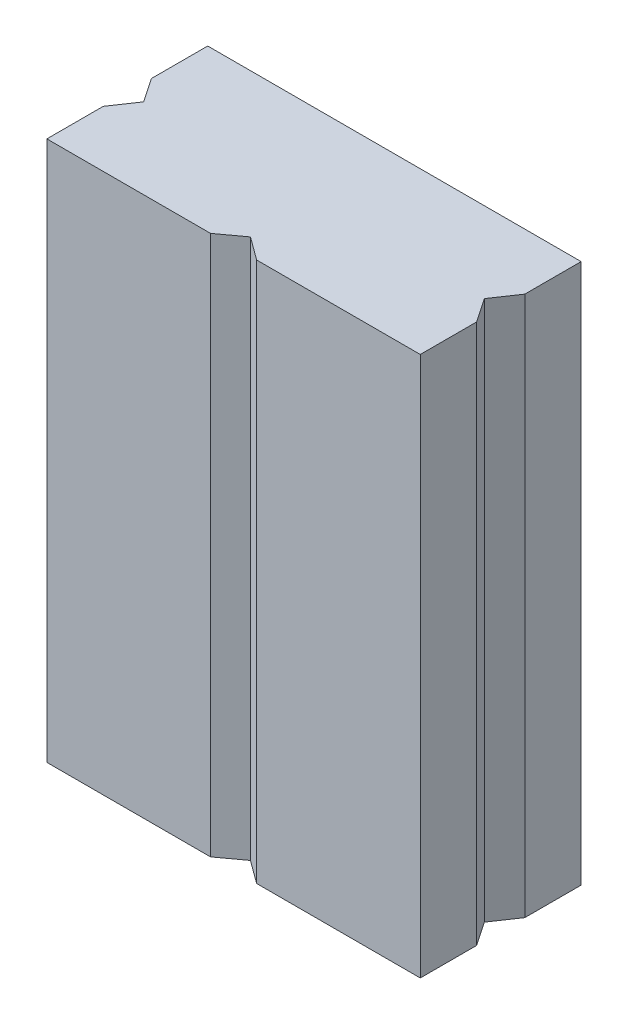
ISO-10303-21;
HEADER;
FILE_DESCRIPTION(('STEP AP214'),'2;1');
FILE_NAME('part.step','',(''),(''),'','','');
FILE_SCHEMA(('AUTOMOTIVE_DESIGN { 1 0 10303 214 1 1 1 1 }'));
ENDSEC;
DATA;
#1=APPLICATION_CONTEXT('core data for automotive mechanical design processes');
#2=APPLICATION_PROTOCOL_DEFINITION('international standard','automotive_design',2000,#1);
#3=PRODUCT_CONTEXT('',#1,'mechanical');
#4=PRODUCT('Part','Part','',(#3));
#5=PRODUCT_RELATED_PRODUCT_CATEGORY('part','',(#4));
#6=PRODUCT_DEFINITION_FORMATION('','',#4);
#7=PRODUCT_DEFINITION_CONTEXT('part definition',#1,'design');
#8=PRODUCT_DEFINITION('design','',#6,#7);
#9=PRODUCT_DEFINITION_SHAPE('','',#8);
#10=(LENGTH_UNIT() NAMED_UNIT(*) SI_UNIT(.MILLI.,.METRE.));
#11=(NAMED_UNIT(*) PLANE_ANGLE_UNIT() SI_UNIT($,.RADIAN.));
#12=(NAMED_UNIT(*) SI_UNIT($,.STERADIAN.) SOLID_ANGLE_UNIT());
#13=UNCERTAINTY_MEASURE_WITH_UNIT(LENGTH_MEASURE(1.E-05),#10,'distance_accuracy_value','');
#14=(GEOMETRIC_REPRESENTATION_CONTEXT(3) GLOBAL_UNCERTAINTY_ASSIGNED_CONTEXT((#13)) GLOBAL_UNIT_ASSIGNED_CONTEXT((#10,
#11,#12)) REPRESENTATION_CONTEXT('',''));
#15=CARTESIAN_POINT('',(0.,0.,0.));
#16=DIRECTION('',(0.,0.,1.));
#17=DIRECTION('',(1.,0.,0.));
#18=AXIS2_PLACEMENT_3D('',#15,#16,#17);
#19=CARTESIAN_POINT('',(9.9432888395153,94.,13.5786649910923));
#20=DIRECTION('',(0.590807171669104,0.,0.806812794831834));
#21=DIRECTION('',(0.806812794831834,0.,-0.590807171669104));
#22=AXIS2_PLACEMENT_3D('',#19,#20,#21);
#23=PLANE('',#22);
#24=DIRECTION('',(-0.806812794831834,0.,0.590807171669104));
#25=VECTOR('',#24,1.);
#26=CARTESIAN_POINT('',(9.9432888395153,0.,13.5786649910923));
#27=LINE('',#26,#25);
#28=CARTESIAN_POINT('',(32.5,0.,-2.93900404966774));
#29=VERTEX_POINT('',#28);
#30=CARTESIAN_POINT('',(28.486463629689,0.,0.));
#31=VERTEX_POINT('',#30);
#32=EDGE_CURVE('E184',#29,#31,#27,.T.);
#33=ORIENTED_EDGE('',*,*,#32,.F.);
#34=DIRECTION('',(0.,-1.,0.));
#35=VECTOR('',#34,1.);
#36=CARTESIAN_POINT('',(32.5,94.,-2.93900404966774));
#37=LINE('',#36,#35);
#38=CARTESIAN_POINT('',(32.5,94.,-2.93900404966774));
#39=VERTEX_POINT('',#38);
#40=EDGE_CURVE('E11',#39,#29,#37,.T.);
#41=ORIENTED_EDGE('',*,*,#40,.F.);
#42=DIRECTION('',(-0.806812794831834,0.,0.590807171669104));
#43=VECTOR('',#42,1.);
#44=CARTESIAN_POINT('',(9.9432888395153,94.,13.5786649910923));
#45=LINE('',#44,#43);
#46=CARTESIAN_POINT('',(28.486463629689,94.,0.));
#47=VERTEX_POINT('',#46);
#48=EDGE_CURVE('E176',#39,#47,#45,.T.);
#49=ORIENTED_EDGE('',*,*,#48,.T.);
#50=DIRECTION('',(0.,-1.,0.));
#51=VECTOR('',#50,1.);
#52=CARTESIAN_POINT('',(28.486463629689,94.,0.));
#53=LINE('',#52,#51);
#54=EDGE_CURVE('E102',#47,#31,#53,.T.);
#55=ORIENTED_EDGE('',*,*,#54,.T.);
#56=EDGE_LOOP('',(#33,#41,#49,#55));
#57=FACE_BOUND('',#56,.T.);
#58=ADVANCED_FACE('F36',(#57),#23,.T.);
#59=CARTESIAN_POINT('',(12.7451635767017,94.,-17.4049360586753));
#60=DIRECTION('',(0.590807171669104,0.,-0.806812794831834));
#61=DIRECTION('',(-0.806812794831834,0.,-0.590807171669104));
#62=AXIS2_PLACEMENT_3D('',#59,#60,#61);
#63=PLANE('',#62);
#64=DIRECTION('',(0.806812794831834,0.,0.590807171669104));
#65=VECTOR('',#64,1.);
#66=CARTESIAN_POINT('',(12.7451635767017,0.,-17.4049360586753));
#67=LINE('',#66,#65);
#68=CARTESIAN_POINT('',(36.513536370311,0.,0.));
#69=VERTEX_POINT('',#68);
#70=EDGE_CURVE('E188',#29,#69,#67,.T.);
#71=ORIENTED_EDGE('',*,*,#70,.T.);
#72=DIRECTION('',(0.,-1.,0.));
#73=VECTOR('',#72,1.);
#74=CARTESIAN_POINT('',(36.513536370311,94.,0.));
#75=LINE('',#74,#73);
#76=CARTESIAN_POINT('',(36.513536370311,94.,0.));
#77=VERTEX_POINT('',#76);
#78=EDGE_CURVE('E44',#77,#69,#75,.T.);
#79=ORIENTED_EDGE('',*,*,#78,.F.);
#80=DIRECTION('',(0.806812794831834,0.,0.590807171669104));
#81=VECTOR('',#80,1.);
#82=CARTESIAN_POINT('',(12.7451635767017,94.,-17.4049360586753));
#83=LINE('',#82,#81);
#84=EDGE_CURVE('E174',#39,#77,#83,.T.);
#85=ORIENTED_EDGE('',*,*,#84,.F.);
#86=ORIENTED_EDGE('',*,*,#40,.T.);
#87=EDGE_LOOP('',(#71,#79,#85,#86));
#88=FACE_BOUND('',#87,.T.);
#89=ADVANCED_FACE('F252',(#88),#63,.F.);
#90=CARTESIAN_POINT('',(0.,94.,0.));
#91=DIRECTION('',(0.,0.,-1.));
#92=DIRECTION('',(-1.,0.,0.));
#93=AXIS2_PLACEMENT_3D('',#90,#91,#92);
#94=PLANE('',#93);
#95=DIRECTION('',(1.,0.,0.));
#96=VECTOR('',#95,1.);
#97=CARTESIAN_POINT('',(0.,0.,0.));
#98=LINE('',#97,#96);
#99=CARTESIAN_POINT('',(65.,0.,0.));
#100=VERTEX_POINT('',#99);
#101=EDGE_CURVE('E193',#69,#100,#98,.T.);
#102=ORIENTED_EDGE('',*,*,#101,.T.);
#103=DIRECTION('',(0.,-1.,0.));
#104=VECTOR('',#103,1.);
#105=CARTESIAN_POINT('',(65.,94.,0.));
#106=LINE('',#105,#104);
#107=CARTESIAN_POINT('',(65.,94.,0.));
#108=VERTEX_POINT('',#107);
#109=EDGE_CURVE('E233',#108,#100,#106,.T.);
#110=ORIENTED_EDGE('',*,*,#109,.F.);
#111=DIRECTION('',(1.,0.,0.));
#112=VECTOR('',#111,1.);
#113=CARTESIAN_POINT('',(0.,94.,0.));
#114=LINE('',#113,#112);
#115=EDGE_CURVE('E157',#77,#108,#114,.T.);
#116=ORIENTED_EDGE('',*,*,#115,.F.);
#117=ORIENTED_EDGE('',*,*,#78,.T.);
#118=EDGE_LOOP('',(#102,#110,#116,#117));
#119=FACE_BOUND('',#118,.T.);
#120=ADVANCED_FACE('F240',(#119),#94,.F.);
#121=CARTESIAN_POINT('',(65.,94.,0.));
#122=DIRECTION('',(-1.,0.,0.));
#123=DIRECTION('',(0.,0.,1.));
#124=AXIS2_PLACEMENT_3D('',#121,#122,#123);
#125=PLANE('',#124);
#126=DIRECTION('',(0.,0.,-1.));
#127=VECTOR('',#126,1.);
#128=CARTESIAN_POINT('',(65.,0.,0.));
#129=LINE('',#128,#127);
#130=CARTESIAN_POINT('',(65.,0.,-9.80576368607577));
#131=VERTEX_POINT('',#130);
#132=EDGE_CURVE('E197',#100,#131,#129,.T.);
#133=ORIENTED_EDGE('',*,*,#132,.T.);
#134=DIRECTION('',(0.,-1.,0.));
#135=VECTOR('',#134,1.);
#136=CARTESIAN_POINT('',(65.,94.,-9.80576368607577));
#137=LINE('',#136,#135);
#138=CARTESIAN_POINT('',(65.,94.,-9.80576368607577));
#139=VERTEX_POINT('',#138);
#140=EDGE_CURVE('E231',#139,#131,#137,.T.);
#141=ORIENTED_EDGE('',*,*,#140,.F.);
#142=DIRECTION('',(0.,0.,-1.));
#143=VECTOR('',#142,1.);
#144=CARTESIAN_POINT('',(65.,94.,0.));
#145=LINE('',#144,#143);
#146=EDGE_CURVE('E168',#108,#139,#145,.T.);
#147=ORIENTED_EDGE('',*,*,#146,.F.);
#148=ORIENTED_EDGE('',*,*,#109,.T.);
#149=EDGE_LOOP('',(#133,#141,#147,#148));
#150=FACE_BOUND('',#149,.T.);
#151=ADVANCED_FACE('F249',(#150),#125,.F.);
#152=CARTESIAN_POINT('',(49.1503968274011,94.,-33.2410634335504));
#153=DIRECTION('',(0.828343903131239,0.,-0.560219937297223));
#154=DIRECTION('',(-0.560219937297223,0.,-0.828343903131239));
#155=AXIS2_PLACEMENT_3D('',#152,#153,#154);
#156=PLANE('',#155);
#157=DIRECTION('',(0.560219937297223,0.,0.828343903131239));
#158=VECTOR('',#157,1.);
#159=CARTESIAN_POINT('',(49.1503968274011,0.,-33.2410634335504));
#160=LINE('',#159,#158);
#161=CARTESIAN_POINT('',(62.1633825082623,0.,-14.));
#162=VERTEX_POINT('',#161);
#163=EDGE_CURVE('E200',#162,#131,#160,.T.);
#164=ORIENTED_EDGE('',*,*,#163,.F.);
#165=DIRECTION('',(0.,-1.,0.));
#166=VECTOR('',#165,1.);
#167=CARTESIAN_POINT('',(62.1633825082623,94.,-14.));
#168=LINE('',#167,#166);
#169=CARTESIAN_POINT('',(62.1633825082623,94.,-14.));
#170=VERTEX_POINT('',#169);
#171=EDGE_CURVE('E229',#170,#162,#168,.T.);
#172=ORIENTED_EDGE('',*,*,#171,.F.);
#173=DIRECTION('',(0.560219937297223,0.,0.828343903131239));
#174=VECTOR('',#173,1.);
#175=CARTESIAN_POINT('',(49.1503968274011,94.,-33.2410634335504));
#176=LINE('',#175,#174);
#177=EDGE_CURVE('E171',#170,#139,#176,.T.);
#178=ORIENTED_EDGE('',*,*,#177,.T.);
#179=ORIENTED_EDGE('',*,*,#140,.T.);
#180=EDGE_LOOP('',(#164,#172,#178,#179));
#181=FACE_BOUND('',#180,.T.);
#182=ADVANCED_FACE('F261',(#181),#156,.T.);
#183=CARTESIAN_POINT('',(36.156863282165,94.,24.4533648454819));
#184=DIRECTION('',(-0.828343903131239,0.,-0.560219937297223));
#185=DIRECTION('',(-0.560219937297223,0.,0.828343903131239));
#186=AXIS2_PLACEMENT_3D('',#183,#184,#185);
#187=PLANE('',#186);
#188=DIRECTION('',(0.560219937297223,0.,-0.828343903131239));
#189=VECTOR('',#188,1.);
#190=CARTESIAN_POINT('',(36.156863282165,0.,24.4533648454819));
#191=LINE('',#190,#189);
#192=CARTESIAN_POINT('',(65.,0.,-18.1942363139242));
#193=VERTEX_POINT('',#192);
#194=EDGE_CURVE('E204',#162,#193,#191,.T.);
#195=ORIENTED_EDGE('',*,*,#194,.T.);
#196=DIRECTION('',(0.,-1.,0.));
#197=VECTOR('',#196,1.);
#198=CARTESIAN_POINT('',(65.,94.,-18.1942363139242));
#199=LINE('',#198,#197);
#200=CARTESIAN_POINT('',(65.,94.,-18.1942363139242));
#201=VERTEX_POINT('',#200);
#202=EDGE_CURVE('E226',#201,#193,#199,.T.);
#203=ORIENTED_EDGE('',*,*,#202,.F.);
#204=DIRECTION('',(0.560219937297223,0.,-0.828343903131239));
#205=VECTOR('',#204,1.);
#206=CARTESIAN_POINT('',(36.156863282165,94.,24.4533648454819));
#207=LINE('',#206,#205);
#208=EDGE_CURVE('E166',#170,#201,#207,.T.);
#209=ORIENTED_EDGE('',*,*,#208,.F.);
#210=ORIENTED_EDGE('',*,*,#171,.T.);
#211=EDGE_LOOP('',(#195,#203,#209,#210));
#212=FACE_BOUND('',#211,.T.);
#213=ADVANCED_FACE('F264',(#212),#187,.F.);
#214=CARTESIAN_POINT('',(65.,0.,-28.));
#215=VERTEX_POINT('',#214);
#216=EDGE_CURVE('E201',#193,#215,#129,.T.);
#217=ORIENTED_EDGE('',*,*,#216,.T.);
#218=DIRECTION('',(0.,-1.,0.));
#219=VECTOR('',#218,1.);
#220=CARTESIAN_POINT('',(65.,94.,-28.));
#221=LINE('',#220,#219);
#222=CARTESIAN_POINT('',(65.,94.,-28.));
#223=VERTEX_POINT('',#222);
#224=EDGE_CURVE('E223',#223,#215,#221,.T.);
#225=ORIENTED_EDGE('',*,*,#224,.F.);
#226=EDGE_CURVE('E163',#201,#223,#145,.T.);
#227=ORIENTED_EDGE('',*,*,#226,.F.);
#228=ORIENTED_EDGE('',*,*,#202,.T.);
#229=EDGE_LOOP('',(#217,#225,#227,#228));
#230=FACE_BOUND('',#229,.T.);
#231=ADVANCED_FACE('F268',(#230),#125,.F.);
#232=CARTESIAN_POINT('',(0.,94.,-28.));
#233=DIRECTION('',(0.,0.,1.));
#234=DIRECTION('',(1.,0.,0.));
#235=AXIS2_PLACEMENT_3D('',#232,#233,#234);
#236=PLANE('',#235);
#237=DIRECTION('',(-1.,0.,0.));
#238=VECTOR('',#237,1.);
#239=CARTESIAN_POINT('',(0.,0.,-28.));
#240=LINE('',#239,#238);
#241=CARTESIAN_POINT('',(0.,0.,-28.));
#242=VERTEX_POINT('',#241);
#243=EDGE_CURVE('E206',#215,#242,#240,.T.);
#244=ORIENTED_EDGE('',*,*,#243,.T.);
#245=DIRECTION('',(0.,-1.,0.));
#246=VECTOR('',#245,1.);
#247=CARTESIAN_POINT('',(0.,94.,-28.));
#248=LINE('',#247,#246);
#249=CARTESIAN_POINT('',(0.,94.,-28.));
#250=VERTEX_POINT('',#249);
#251=EDGE_CURVE('E220',#250,#242,#248,.T.);
#252=ORIENTED_EDGE('',*,*,#251,.F.);
#253=DIRECTION('',(-1.,0.,0.));
#254=VECTOR('',#253,1.);
#255=CARTESIAN_POINT('',(0.,94.,-28.));
#256=LINE('',#255,#254);
#257=EDGE_CURVE('E160',#223,#250,#256,.T.);
#258=ORIENTED_EDGE('',*,*,#257,.F.);
#259=ORIENTED_EDGE('',*,*,#224,.T.);
#260=EDGE_LOOP('',(#244,#252,#258,#259));
#261=FACE_BOUND('',#260,.T.);
#262=ADVANCED_FACE('F272',(#261),#236,.F.);
#263=CARTESIAN_POINT('',(0.,94.,0.));
#264=DIRECTION('',(1.,0.,0.));
#265=DIRECTION('',(0.,0.,-1.));
#266=AXIS2_PLACEMENT_3D('',#263,#264,#265);
#267=PLANE('',#266);
#268=DIRECTION('',(0.,0.,1.));
#269=VECTOR('',#268,1.);
#270=CARTESIAN_POINT('',(0.,0.,0.));
#271=LINE('',#270,#269);
#272=CARTESIAN_POINT('',(0.,0.,-18.1942363139242));
#273=VERTEX_POINT('',#272);
#274=EDGE_CURVE('E208',#242,#273,#271,.T.);
#275=ORIENTED_EDGE('',*,*,#274,.T.);
#276=DIRECTION('',(0.,-1.,0.));
#277=VECTOR('',#276,1.);
#278=CARTESIAN_POINT('',(0.,94.,-18.1942363139242));
#279=LINE('',#278,#277);
#280=CARTESIAN_POINT('',(0.,94.,-18.1942363139242));
#281=VERTEX_POINT('',#280);
#282=EDGE_CURVE('E218',#281,#273,#279,.T.);
#283=ORIENTED_EDGE('',*,*,#282,.F.);
#284=DIRECTION('',(0.,0.,1.));
#285=VECTOR('',#284,1.);
#286=CARTESIAN_POINT('',(0.,94.,0.));
#287=LINE('',#286,#285);
#288=EDGE_CURVE('E155',#250,#281,#287,.T.);
#289=ORIENTED_EDGE('',*,*,#288,.F.);
#290=ORIENTED_EDGE('',*,*,#251,.T.);
#291=EDGE_LOOP('',(#275,#283,#289,#290));
#292=FACE_BOUND('',#291,.T.);
#293=ADVANCED_FACE('F276',(#292),#267,.F.);
#294=CARTESIAN_POINT('',(8.44312213839028,94.,-5.71019517024488));
#295=DIRECTION('',(-0.828343903131239,0.,0.560219937297223));
#296=DIRECTION('',(0.560219937297223,0.,0.828343903131239));
#297=AXIS2_PLACEMENT_3D('',#294,#295,#296);
#298=PLANE('',#297);
#299=DIRECTION('',(-0.560219937297223,0.,-0.828343903131239));
#300=VECTOR('',#299,1.);
#301=CARTESIAN_POINT('',(8.44312213839028,0.,-5.71019517024488));
#302=LINE('',#301,#300);
#303=CARTESIAN_POINT('',(2.83661749173769,0.,-14.));
#304=VERTEX_POINT('',#303);
#305=EDGE_CURVE('E211',#304,#273,#302,.T.);
#306=ORIENTED_EDGE('',*,*,#305,.F.);
#307=DIRECTION('',(0.,-1.,0.));
#308=VECTOR('',#307,1.);
#309=CARTESIAN_POINT('',(2.83661749173769,94.,-14.));
#310=LINE('',#309,#308);
#311=CARTESIAN_POINT('',(2.83661749173769,94.,-14.));
#312=VERTEX_POINT('',#311);
#313=EDGE_CURVE('E150',#312,#304,#310,.T.);
#314=ORIENTED_EDGE('',*,*,#313,.F.);
#315=DIRECTION('',(-0.560219937297223,0.,-0.828343903131239));
#316=VECTOR('',#315,1.);
#317=CARTESIAN_POINT('',(8.44312213839028,94.,-5.71019517024488));
#318=LINE('',#317,#316);
#319=EDGE_CURVE('E143',#312,#281,#318,.T.);
#320=ORIENTED_EDGE('',*,*,#319,.T.);
#321=ORIENTED_EDGE('',*,*,#282,.T.);
#322=EDGE_LOOP('',(#306,#314,#320,#321));
#323=FACE_BOUND('',#322,.T.);
#324=ADVANCED_FACE('F278',(#323),#298,.T.);
#325=CARTESIAN_POINT('',(-4.55041140684587,94.,-3.07750341782364));
#326=DIRECTION('',(0.828343903131239,0.,0.560219937297223));
#327=DIRECTION('',(0.560219937297223,0.,-0.828343903131239));
#328=AXIS2_PLACEMENT_3D('',#325,#326,#327);
#329=PLANE('',#328);
#330=DIRECTION('',(-0.560219937297223,0.,0.828343903131239));
#331=VECTOR('',#330,1.);
#332=CARTESIAN_POINT('',(-4.55041140684587,0.,-3.07750341782364));
#333=LINE('',#332,#331);
#334=CARTESIAN_POINT('',(0.,0.,-9.80576368607581));
#335=VERTEX_POINT('',#334);
#336=EDGE_CURVE('E149',#304,#335,#333,.T.);
#337=ORIENTED_EDGE('',*,*,#336,.T.);
#338=DIRECTION('',(0.,-1.,0.));
#339=VECTOR('',#338,1.);
#340=CARTESIAN_POINT('',(0.,94.,-9.80576368607581));
#341=LINE('',#340,#339);
#342=CARTESIAN_POINT('',(0.,94.,-9.80576368607581));
#343=VERTEX_POINT('',#342);
#344=EDGE_CURVE('E146',#343,#335,#341,.T.);
#345=ORIENTED_EDGE('',*,*,#344,.F.);
#346=DIRECTION('',(-0.560219937297223,0.,0.828343903131239));
#347=VECTOR('',#346,1.);
#348=CARTESIAN_POINT('',(-4.55041140684587,94.,-3.07750341782364));
#349=LINE('',#348,#347);
#350=EDGE_CURVE('E137',#312,#343,#349,.T.);
#351=ORIENTED_EDGE('',*,*,#350,.F.);
#352=ORIENTED_EDGE('',*,*,#313,.T.);
#353=EDGE_LOOP('',(#337,#345,#351,#352));
#354=FACE_BOUND('',#353,.T.);
#355=ADVANCED_FACE('F147',(#354),#329,.F.);
#356=CARTESIAN_POINT('',(0.,0.,0.));
#357=VERTEX_POINT('',#356);
#358=EDGE_CURVE('E95',#335,#357,#271,.T.);
#359=ORIENTED_EDGE('',*,*,#358,.T.);
#360=DIRECTION('',(0.,-1.,0.));
#361=VECTOR('',#360,1.);
#362=CARTESIAN_POINT('',(0.,94.,0.));
#363=LINE('',#362,#361);
#364=CARTESIAN_POINT('',(0.,94.,0.));
#365=VERTEX_POINT('',#364);
#366=EDGE_CURVE('E151',#365,#357,#363,.T.);
#367=ORIENTED_EDGE('',*,*,#366,.F.);
#368=EDGE_CURVE('E141',#343,#365,#287,.T.);
#369=ORIENTED_EDGE('',*,*,#368,.F.);
#370=ORIENTED_EDGE('',*,*,#344,.T.);
#371=EDGE_LOOP('',(#359,#367,#369,#370));
#372=FACE_BOUND('',#371,.T.);
#373=ADVANCED_FACE('F153',(#372),#267,.F.);
#374=EDGE_CURVE('E178',#357,#31,#98,.T.);
#375=ORIENTED_EDGE('',*,*,#374,.T.);
#376=ORIENTED_EDGE('',*,*,#54,.F.);
#377=EDGE_CURVE('E52',#365,#47,#114,.T.);
#378=ORIENTED_EDGE('',*,*,#377,.F.);
#379=ORIENTED_EDGE('',*,*,#366,.T.);
#380=EDGE_LOOP('',(#375,#376,#378,#379));
#381=FACE_BOUND('',#380,.T.);
#382=ADVANCED_FACE('F259',(#381),#94,.F.);
#383=CARTESIAN_POINT('',(0.,94.,0.));
#384=DIRECTION('',(0.,1.,0.));
#385=DIRECTION('',(0.,0.,1.));
#386=AXIS2_PLACEMENT_3D('',#383,#384,#385);
#387=PLANE('',#386);
#388=ORIENTED_EDGE('',*,*,#48,.F.);
#389=ORIENTED_EDGE('',*,*,#84,.T.);
#390=ORIENTED_EDGE('',*,*,#115,.T.);
#391=ORIENTED_EDGE('',*,*,#146,.T.);
#392=ORIENTED_EDGE('',*,*,#177,.F.);
#393=ORIENTED_EDGE('',*,*,#208,.T.);
#394=ORIENTED_EDGE('',*,*,#226,.T.);
#395=ORIENTED_EDGE('',*,*,#257,.T.);
#396=ORIENTED_EDGE('',*,*,#288,.T.);
#397=ORIENTED_EDGE('',*,*,#319,.F.);
#398=ORIENTED_EDGE('',*,*,#350,.T.);
#399=ORIENTED_EDGE('',*,*,#368,.T.);
#400=ORIENTED_EDGE('',*,*,#377,.T.);
#401=EDGE_LOOP('',(#388,#389,#390,#391,#392,#393,#394,#395,#396,#397,#398,#399,#400));
#402=FACE_BOUND('',#401,.T.);
#403=ADVANCED_FACE('F139',(#402),#387,.T.);
#404=CARTESIAN_POINT('',(0.,0.,0.));
#405=DIRECTION('',(0.,1.,0.));
#406=DIRECTION('',(0.,0.,1.));
#407=AXIS2_PLACEMENT_3D('',#404,#405,#406);
#408=PLANE('',#407);
#409=CARTESIAN_POINT('',(12.697649227178,0.,-14.));
#410=DIRECTION('',(0.,1.,0.));
#411=DIRECTION('',(0.,0.,1.));
#412=AXIS2_PLACEMENT_3D('',#409,#410,#411);
#413=CIRCLE('',#412,2.40784246025548);
#414=CARTESIAN_POINT('',(12.697649227178,0.,-11.5921575397445));
#415=VERTEX_POINT('',#414);
#416=EDGE_CURVE('E179',#415,#415,#413,.T.);
#417=ORIENTED_EDGE('',*,*,#416,.T.);
#418=EDGE_LOOP('',(#417));
#419=FACE_BOUND('',#418,.T.);
#420=ORIENTED_EDGE('',*,*,#32,.T.);
#421=ORIENTED_EDGE('',*,*,#374,.F.);
#422=ORIENTED_EDGE('',*,*,#358,.F.);
#423=ORIENTED_EDGE('',*,*,#336,.F.);
#424=ORIENTED_EDGE('',*,*,#305,.T.);
#425=ORIENTED_EDGE('',*,*,#274,.F.);
#426=ORIENTED_EDGE('',*,*,#243,.F.);
#427=ORIENTED_EDGE('',*,*,#216,.F.);
#428=ORIENTED_EDGE('',*,*,#194,.F.);
#429=ORIENTED_EDGE('',*,*,#163,.T.);
#430=ORIENTED_EDGE('',*,*,#132,.F.);
#431=ORIENTED_EDGE('',*,*,#101,.F.);
#432=ORIENTED_EDGE('',*,*,#70,.F.);
#433=EDGE_LOOP('',(#420,#421,#422,#423,#424,#425,#426,#427,#428,#429,#430,#431,#432));
#434=FACE_BOUND('',#433,.T.);
#435=ADVANCED_FACE('F244',(#419,#434),#408,.F.);
#436=CARTESIAN_POINT('',(12.697649227178,5.,-14.));
#437=DIRECTION('',(0.,-1.,0.));
#438=DIRECTION('',(0.,0.,-1.));
#439=AXIS2_PLACEMENT_3D('',#436,#437,#438);
#440=CYLINDRICAL_SURFACE('',#439,2.40784246025548);
#441=CARTESIAN_POINT('',(12.697649227178,5.,-14.));
#442=DIRECTION('',(0.,1.,0.));
#443=DIRECTION('',(0.,0.,1.));
#444=AXIS2_PLACEMENT_3D('',#441,#442,#443);
#445=CIRCLE('',#444,2.40784246025548);
#446=CARTESIAN_POINT('',(12.697649227178,5.,-11.5921575397445));
#447=VERTEX_POINT('',#446);
#448=EDGE_CURVE('E182',#447,#447,#445,.T.);
#449=ORIENTED_EDGE('',*,*,#448,.T.);
#450=EDGE_LOOP('',(#449));
#451=FACE_BOUND('',#450,.T.);
#452=ORIENTED_EDGE('',*,*,#416,.F.);
#453=EDGE_LOOP('',(#452));
#454=FACE_BOUND('',#453,.T.);
#455=ADVANCED_FACE('F290',(#451,#454),#440,.F.);
#456=CARTESIAN_POINT('',(0.,5.,0.));
#457=DIRECTION('',(0.,1.,0.));
#458=DIRECTION('',(0.,0.,1.));
#459=AXIS2_PLACEMENT_3D('',#456,#457,#458);
#460=PLANE('',#459);
#461=ORIENTED_EDGE('',*,*,#448,.F.);
#462=EDGE_LOOP('',(#461));
#463=FACE_BOUND('',#462,.T.);
#464=ADVANCED_FACE('F296',(#463),#460,.F.);
#465=CLOSED_SHELL('',(#58,#89,#120,#151,#182,#213,#231,#262,#293,#324,#355,#373,#382,#403,#435,
#455,#464));
#466=MANIFOLD_SOLID_BREP('B2',#465);
#467=ADVANCED_BREP_SHAPE_REPRESENTATION('',(#18,#466),#14);
#468=SHAPE_DEFINITION_REPRESENTATION(#9,#467);
ENDSEC;
END-ISO-10303-21;
